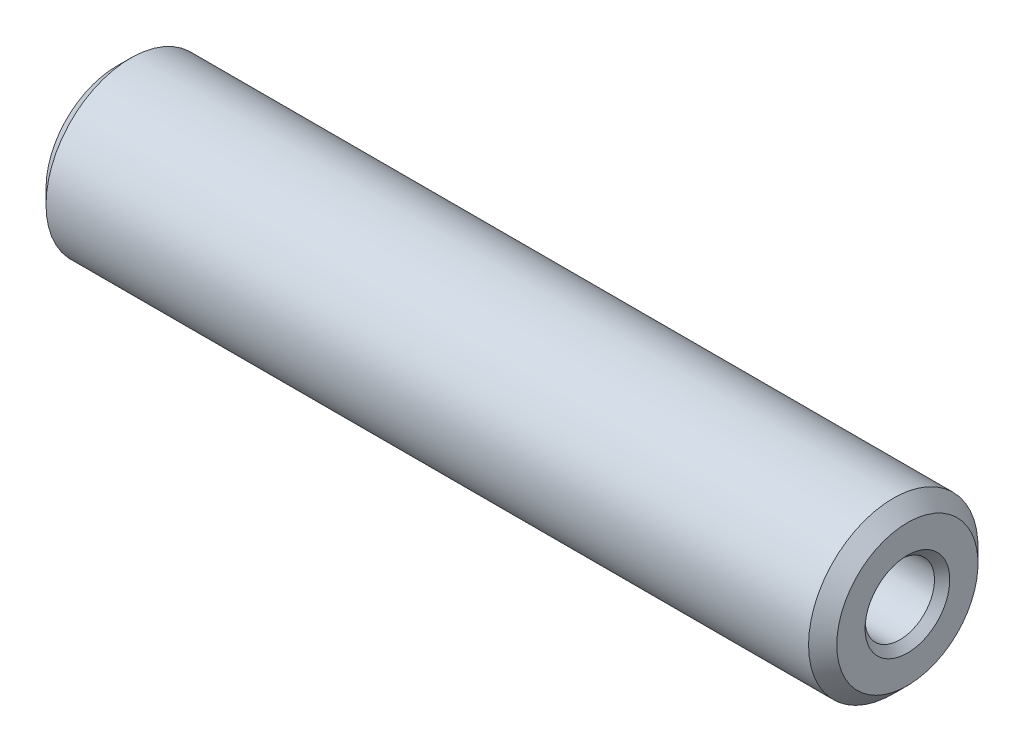
ISO-10303-21;
HEADER;
FILE_DESCRIPTION(('STEP AP214'),'2;1');
FILE_NAME('part.step','',(''),(''),'','','');
FILE_SCHEMA(('AUTOMOTIVE_DESIGN { 1 0 10303 214 1 1 1 1 }'));
ENDSEC;
DATA;
#1=APPLICATION_CONTEXT('core data for automotive mechanical design processes');
#2=APPLICATION_PROTOCOL_DEFINITION('international standard','automotive_design',2000,#1);
#3=PRODUCT_CONTEXT('',#1,'mechanical');
#4=PRODUCT('Part','Part','',(#3));
#5=PRODUCT_RELATED_PRODUCT_CATEGORY('part','',(#4));
#6=PRODUCT_DEFINITION_FORMATION('','',#4);
#7=PRODUCT_DEFINITION_CONTEXT('part definition',#1,'design');
#8=PRODUCT_DEFINITION('design','',#6,#7);
#9=PRODUCT_DEFINITION_SHAPE('','',#8);
#10=(LENGTH_UNIT() NAMED_UNIT(*) SI_UNIT(.MILLI.,.METRE.));
#11=(NAMED_UNIT(*) PLANE_ANGLE_UNIT() SI_UNIT($,.RADIAN.));
#12=(NAMED_UNIT(*) SI_UNIT($,.STERADIAN.) SOLID_ANGLE_UNIT());
#13=UNCERTAINTY_MEASURE_WITH_UNIT(LENGTH_MEASURE(1.E-05),#10,'distance_accuracy_value','');
#14=(GEOMETRIC_REPRESENTATION_CONTEXT(3) GLOBAL_UNCERTAINTY_ASSIGNED_CONTEXT((#13)) GLOBAL_UNIT_ASSIGNED_CONTEXT((#10,
#11,#12)) REPRESENTATION_CONTEXT('',''));
#15=CARTESIAN_POINT('',(0.,0.,0.));
#16=DIRECTION('',(0.,0.,1.));
#17=DIRECTION('',(1.,0.,0.));
#18=AXIS2_PLACEMENT_3D('',#15,#16,#17);
#19=CARTESIAN_POINT('',(27.9999999999958,7.25933066913695E-09,0.));
#20=DIRECTION('',(-1.,0.,0.));
#21=DIRECTION('',(0.,0.,1.));
#22=AXIS2_PLACEMENT_3D('',#19,#20,#21);
#23=CYLINDRICAL_SURFACE('',#22,1.22949999274067);
#24=CARTESIAN_POINT('',(17.209852155969,7.25933066913695E-09,0.));
#25=DIRECTION('',(-1.,0.,0.));
#26=DIRECTION('',(0.,0.,1.));
#27=AXIS2_PLACEMENT_3D('',#24,#25,#26);
#28=CIRCLE('',#27,1.22949999274067);
#29=CARTESIAN_POINT('',(17.209852155969,7.25933066913695E-09,1.22949999274067));
#30=VERTEX_POINT('',#29);
#31=EDGE_CURVE('E11',#30,#30,#28,.T.);
#32=ORIENTED_EDGE('',*,*,#31,.T.);
#33=EDGE_LOOP('',(#32));
#34=FACE_BOUND('',#33,.T.);
#35=CARTESIAN_POINT('',(27.7295,7.25933066913695E-09,0.));
#36=DIRECTION('',(-1.,0.,0.));
#37=DIRECTION('',(0.,0.,1.));
#38=AXIS2_PLACEMENT_3D('',#35,#36,#37);
#39=CIRCLE('',#38,1.22949999274067);
#40=CARTESIAN_POINT('',(27.7295,7.25933066913695E-09,1.22949999274067));
#41=VERTEX_POINT('',#40);
#42=EDGE_CURVE('E56',#41,#41,#39,.T.);
#43=ORIENTED_EDGE('',*,*,#42,.F.);
#44=EDGE_LOOP('',(#43));
#45=FACE_BOUND('',#44,.T.);
#46=ADVANCED_FACE('F33',(#34,#45),#23,.F.);
#47=CARTESIAN_POINT('',(17.209852155969,7.25933066913695E-09,0.));
#48=DIRECTION('',(1.,0.,0.));
#49=DIRECTION('',(0.,0.,-1.));
#50=AXIS2_PLACEMENT_3D('',#47,#48,#49);
#51=CONICAL_SURFACE('',#50,1.22949999274067,1.0471975511966);
#52=CARTESIAN_POINT('',(16.5000000041915,7.25933066913695E-09,0.));
#53=VERTEX_POINT('',#52);
#54=VERTEX_LOOP('',#53);
#55=FACE_BOUND('',#54,.T.);
#56=ORIENTED_EDGE('',*,*,#31,.F.);
#57=EDGE_LOOP('',(#56));
#58=FACE_BOUND('',#57,.T.);
#59=ADVANCED_FACE('F46',(#55,#58),#51,.F.);
#60=CARTESIAN_POINT('',(11.4999999999899,7.25933066913695E-09,0.));
#61=DIRECTION('',(-1.,0.,0.));
#62=DIRECTION('',(0.,0.,1.));
#63=AXIS2_PLACEMENT_3D('',#60,#61,#62);
#64=CONICAL_SURFACE('',#63,0.,1.04719754864592);
#65=CARTESIAN_POINT('',(10.790147844031,7.25933066913695E-09,0.));
#66=DIRECTION('',(-1.,0.,0.));
#67=DIRECTION('',(0.,0.,1.));
#68=AXIS2_PLACEMENT_3D('',#65,#66,#67);
#69=CIRCLE('',#68,1.22949999274067);
#70=CARTESIAN_POINT('',(10.790147844031,7.25933066913695E-09,1.22949999274067));
#71=VERTEX_POINT('',#70);
#72=EDGE_CURVE('E40',#71,#71,#69,.T.);
#73=ORIENTED_EDGE('',*,*,#72,.T.);
#74=EDGE_LOOP('',(#73));
#75=FACE_BOUND('',#74,.T.);
#76=CARTESIAN_POINT('',(11.4999999999899,7.25933066913695E-09,0.));
#77=VERTEX_POINT('',#76);
#78=VERTEX_LOOP('',#77);
#79=FACE_BOUND('',#78,.T.);
#80=ADVANCED_FACE('F49',(#75,#79),#64,.F.);
#81=CARTESIAN_POINT('',(27.9999999999958,7.25933066913695E-09,0.));
#82=DIRECTION('',(-1.,0.,0.));
#83=DIRECTION('',(0.,0.,1.));
#84=AXIS2_PLACEMENT_3D('',#81,#82,#83);
#85=CYLINDRICAL_SURFACE('',#84,1.22949999274067);
#86=CARTESIAN_POINT('',(0.2705,7.25933066913695E-09,0.));
#87=DIRECTION('',(-1.,0.,0.));
#88=DIRECTION('',(0.,0.,1.));
#89=AXIS2_PLACEMENT_3D('',#86,#87,#88);
#90=CIRCLE('',#89,1.22949999274067);
#91=CARTESIAN_POINT('',(0.2705,7.25933066913695E-09,1.22949999274067));
#92=VERTEX_POINT('',#91);
#93=EDGE_CURVE('E78',#92,#92,#90,.T.);
#94=ORIENTED_EDGE('',*,*,#93,.T.);
#95=EDGE_LOOP('',(#94));
#96=FACE_BOUND('',#95,.T.);
#97=ORIENTED_EDGE('',*,*,#72,.F.);
#98=EDGE_LOOP('',(#97));
#99=FACE_BOUND('',#98,.T.);
#100=ADVANCED_FACE('F84',(#96,#99),#85,.F.);
#101=CARTESIAN_POINT('',(0.2705,7.25933066913695E-09,0.));
#102=DIRECTION('',(-1.,0.,0.));
#103=DIRECTION('',(0.,0.,1.));
#104=AXIS2_PLACEMENT_3D('',#101,#102,#103);
#105=CONICAL_SURFACE('',#104,1.22949999274067,0.785398163397448);
#106=CARTESIAN_POINT('',(0.,7.25933066913695E-09,0.));
#107=DIRECTION('',(-1.,0.,0.));
#108=DIRECTION('',(0.,0.,1.));
#109=AXIS2_PLACEMENT_3D('',#106,#107,#108);
#110=CIRCLE('',#109,1.49999999274067);
#111=CARTESIAN_POINT('',(0.,7.25933066913695E-09,1.49999999274067));
#112=VERTEX_POINT('',#111);
#113=EDGE_CURVE('E75',#112,#112,#110,.T.);
#114=ORIENTED_EDGE('',*,*,#113,.T.);
#115=EDGE_LOOP('',(#114));
#116=FACE_BOUND('',#115,.T.);
#117=ORIENTED_EDGE('',*,*,#93,.F.);
#118=EDGE_LOOP('',(#117));
#119=FACE_BOUND('',#118,.T.);
#120=ADVANCED_FACE('F86',(#116,#119),#105,.F.);
#121=CARTESIAN_POINT('',(0.,1.5,0.));
#122=DIRECTION('',(-1.,0.,0.));
#123=DIRECTION('',(0.,0.,1.));
#124=AXIS2_PLACEMENT_3D('',#121,#122,#123);
#125=PLANE('',#124);
#126=CARTESIAN_POINT('',(0.,7.25933066913695E-09,0.));
#127=DIRECTION('',(-1.,0.,0.));
#128=DIRECTION('',(0.,0.,1.));
#129=AXIS2_PLACEMENT_3D('',#126,#127,#128);
#130=CIRCLE('',#129,2.49999999274067);
#131=CARTESIAN_POINT('',(0.,7.25933066913695E-09,2.49999999274067));
#132=VERTEX_POINT('',#131);
#133=EDGE_CURVE('E72',#132,#132,#130,.T.);
#134=ORIENTED_EDGE('',*,*,#133,.T.);
#135=EDGE_LOOP('',(#134));
#136=FACE_BOUND('',#135,.T.);
#137=ORIENTED_EDGE('',*,*,#113,.F.);
#138=EDGE_LOOP('',(#137));
#139=FACE_BOUND('',#138,.T.);
#140=ADVANCED_FACE('F93',(#136,#139),#125,.T.);
#141=CARTESIAN_POINT('',(0.,7.25933066913695E-09,0.));
#142=DIRECTION('',(1.,0.,0.));
#143=DIRECTION('',(0.,0.,-1.));
#144=AXIS2_PLACEMENT_3D('',#141,#142,#143);
#145=CONICAL_SURFACE('',#144,2.49999999274067,0.785398163397451);
#146=CARTESIAN_POINT('',(0.5,7.25933066913695E-09,0.));
#147=DIRECTION('',(-1.,0.,0.));
#148=DIRECTION('',(0.,0.,1.));
#149=AXIS2_PLACEMENT_3D('',#146,#147,#148);
#150=CIRCLE('',#149,2.99999999274067);
#151=CARTESIAN_POINT('',(0.5,7.25933066913695E-09,2.99999999274067));
#152=VERTEX_POINT('',#151);
#153=EDGE_CURVE('E69',#152,#152,#150,.T.);
#154=ORIENTED_EDGE('',*,*,#153,.T.);
#155=EDGE_LOOP('',(#154));
#156=FACE_BOUND('',#155,.T.);
#157=ORIENTED_EDGE('',*,*,#133,.F.);
#158=EDGE_LOOP('',(#157));
#159=FACE_BOUND('',#158,.T.);
#160=ADVANCED_FACE('F100',(#156,#159),#145,.T.);
#161=CARTESIAN_POINT('',(27.9999999999958,7.25933066913695E-09,0.));
#162=DIRECTION('',(-1.,0.,0.));
#163=DIRECTION('',(0.,0.,1.));
#164=AXIS2_PLACEMENT_3D('',#161,#162,#163);
#165=CYLINDRICAL_SURFACE('',#164,2.99999999274067);
#166=CARTESIAN_POINT('',(27.5,7.25933066913695E-09,0.));
#167=DIRECTION('',(-1.,0.,0.));
#168=DIRECTION('',(0.,0.,1.));
#169=AXIS2_PLACEMENT_3D('',#166,#167,#168);
#170=CIRCLE('',#169,2.99999999274067);
#171=CARTESIAN_POINT('',(27.5,7.25933066913695E-09,2.99999999274067));
#172=VERTEX_POINT('',#171);
#173=EDGE_CURVE('E66',#172,#172,#170,.T.);
#174=ORIENTED_EDGE('',*,*,#173,.T.);
#175=EDGE_LOOP('',(#174));
#176=FACE_BOUND('',#175,.T.);
#177=ORIENTED_EDGE('',*,*,#153,.F.);
#178=EDGE_LOOP('',(#177));
#179=FACE_BOUND('',#178,.T.);
#180=ADVANCED_FACE('F104',(#176,#179),#165,.T.);
#181=CARTESIAN_POINT('',(27.5,7.25933066913695E-09,0.));
#182=DIRECTION('',(-1.,0.,0.));
#183=DIRECTION('',(0.,0.,1.));
#184=AXIS2_PLACEMENT_3D('',#181,#182,#183);
#185=CONICAL_SURFACE('',#184,2.99999999274067,0.785398163397447);
#186=CARTESIAN_POINT('',(28.,7.25933066913695E-09,0.));
#187=DIRECTION('',(-1.,0.,0.));
#188=DIRECTION('',(0.,0.,1.));
#189=AXIS2_PLACEMENT_3D('',#186,#187,#188);
#190=CIRCLE('',#189,2.49999999274067);
#191=CARTESIAN_POINT('',(28.,7.25933066913695E-09,2.49999999274067));
#192=VERTEX_POINT('',#191);
#193=EDGE_CURVE('E61',#192,#192,#190,.T.);
#194=ORIENTED_EDGE('',*,*,#193,.T.);
#195=EDGE_LOOP('',(#194));
#196=FACE_BOUND('',#195,.T.);
#197=ORIENTED_EDGE('',*,*,#173,.F.);
#198=EDGE_LOOP('',(#197));
#199=FACE_BOUND('',#198,.T.);
#200=ADVANCED_FACE('F108',(#196,#199),#185,.T.);
#201=CARTESIAN_POINT('',(28.,2.5,0.));
#202=DIRECTION('',(1.,0.,0.));
#203=DIRECTION('',(0.,0.,-1.));
#204=AXIS2_PLACEMENT_3D('',#201,#202,#203);
#205=PLANE('',#204);
#206=CARTESIAN_POINT('',(28.,7.25933066913695E-09,0.));
#207=DIRECTION('',(-1.,0.,0.));
#208=DIRECTION('',(0.,0.,1.));
#209=AXIS2_PLACEMENT_3D('',#206,#207,#208);
#210=CIRCLE('',#209,1.49999999274067);
#211=CARTESIAN_POINT('',(28.,7.25933066913695E-09,1.49999999274067));
#212=VERTEX_POINT('',#211);
#213=EDGE_CURVE('E58',#212,#212,#210,.T.);
#214=ORIENTED_EDGE('',*,*,#213,.T.);
#215=EDGE_LOOP('',(#214));
#216=FACE_BOUND('',#215,.T.);
#217=ORIENTED_EDGE('',*,*,#193,.F.);
#218=EDGE_LOOP('',(#217));
#219=FACE_BOUND('',#218,.T.);
#220=ADVANCED_FACE('F112',(#216,#219),#205,.T.);
#221=CARTESIAN_POINT('',(28.,7.25933066913695E-09,0.));
#222=DIRECTION('',(1.,0.,0.));
#223=DIRECTION('',(0.,0.,-1.));
#224=AXIS2_PLACEMENT_3D('',#221,#222,#223);
#225=CONICAL_SURFACE('',#224,1.49999999274067,0.785398163397448);
#226=ORIENTED_EDGE('',*,*,#42,.T.);
#227=EDGE_LOOP('',(#226));
#228=FACE_BOUND('',#227,.T.);
#229=ORIENTED_EDGE('',*,*,#213,.F.);
#230=EDGE_LOOP('',(#229));
#231=FACE_BOUND('',#230,.T.);
#232=ADVANCED_FACE('F116',(#228,#231),#225,.F.);
#233=CLOSED_SHELL('',(#46,#59,#80,#100,#120,#140,#160,#180,#200,#220,#232));
#234=MANIFOLD_SOLID_BREP('B2',#233);
#235=ADVANCED_BREP_SHAPE_REPRESENTATION('',(#18,#234),#14);
#236=SHAPE_DEFINITION_REPRESENTATION(#9,#235);
ENDSEC;
END-ISO-10303-21;
